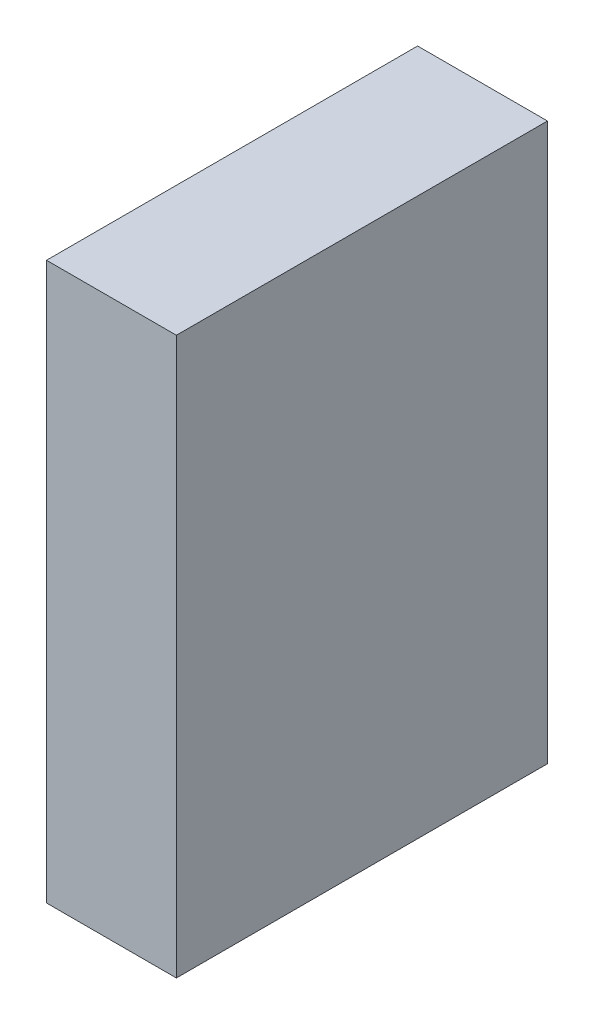
ISO-10303-21;
HEADER;
FILE_DESCRIPTION(('STEP AP214'),'2;1');
FILE_NAME('part.step','',(''),(''),'','','');
FILE_SCHEMA(('AUTOMOTIVE_DESIGN { 1 0 10303 214 1 1 1 1 }'));
ENDSEC;
DATA;
#1=APPLICATION_CONTEXT('core data for automotive mechanical design processes');
#2=APPLICATION_PROTOCOL_DEFINITION('international standard','automotive_design',2000,#1);
#3=PRODUCT_CONTEXT('',#1,'mechanical');
#4=PRODUCT('Part','Part','',(#3));
#5=PRODUCT_RELATED_PRODUCT_CATEGORY('part','',(#4));
#6=PRODUCT_DEFINITION_FORMATION('','',#4);
#7=PRODUCT_DEFINITION_CONTEXT('part definition',#1,'design');
#8=PRODUCT_DEFINITION('design','',#6,#7);
#9=PRODUCT_DEFINITION_SHAPE('','',#8);
#10=(LENGTH_UNIT() NAMED_UNIT(*) SI_UNIT(.MILLI.,.METRE.));
#11=(NAMED_UNIT(*) PLANE_ANGLE_UNIT() SI_UNIT($,.RADIAN.));
#12=(NAMED_UNIT(*) SI_UNIT($,.STERADIAN.) SOLID_ANGLE_UNIT());
#13=UNCERTAINTY_MEASURE_WITH_UNIT(LENGTH_MEASURE(1.E-05),#10,'distance_accuracy_value','');
#14=(GEOMETRIC_REPRESENTATION_CONTEXT(3) GLOBAL_UNCERTAINTY_ASSIGNED_CONTEXT((#13)) GLOBAL_UNIT_ASSIGNED_CONTEXT((#10,
#11,#12)) REPRESENTATION_CONTEXT('',''));
#15=CARTESIAN_POINT('',(0.,0.,0.));
#16=DIRECTION('',(0.,0.,1.));
#17=DIRECTION('',(1.,0.,0.));
#18=AXIS2_PLACEMENT_3D('',#15,#16,#17);
#19=CARTESIAN_POINT('',(0.0889,-0.381,0.));
#20=DIRECTION('',(-1.,0.,0.));
#21=DIRECTION('',(0.,0.,1.));
#22=AXIS2_PLACEMENT_3D('',#19,#20,#21);
#23=PLANE('',#22);
#24=DIRECTION('',(0.,0.,-1.));
#25=VECTOR('',#24,1.);
#26=CARTESIAN_POINT('',(0.0889,0.381,0.));
#27=LINE('',#26,#25);
#28=CARTESIAN_POINT('',(0.0889,0.381,0.));
#29=VERTEX_POINT('',#28);
#30=CARTESIAN_POINT('',(0.0889,0.381,0.508));
#31=VERTEX_POINT('',#30);
#32=EDGE_CURVE('E20',#29,#31,#27,.F.);
#33=ORIENTED_EDGE('',*,*,#32,.T.);
#34=DIRECTION('',(0.,1.,0.));
#35=VECTOR('',#34,1.);
#36=CARTESIAN_POINT('',(0.0889,0.381,0.508));
#37=LINE('',#36,#35);
#38=CARTESIAN_POINT('',(0.0889,-0.381,0.508));
#39=VERTEX_POINT('',#38);
#40=EDGE_CURVE('E55',#31,#39,#37,.F.);
#41=ORIENTED_EDGE('',*,*,#40,.T.);
#42=DIRECTION('',(0.,0.,1.));
#43=VECTOR('',#42,1.);
#44=CARTESIAN_POINT('',(0.0889,-0.381,0.));
#45=LINE('',#44,#43);
#46=CARTESIAN_POINT('',(0.0889,-0.381,0.));
#47=VERTEX_POINT('',#46);
#48=EDGE_CURVE('E74',#39,#47,#45,.F.);
#49=ORIENTED_EDGE('',*,*,#48,.T.);
#50=DIRECTION('',(0.,1.,0.));
#51=VECTOR('',#50,1.);
#52=CARTESIAN_POINT('',(0.0889,0.381,0.));
#53=LINE('',#52,#51);
#54=EDGE_CURVE('E66',#29,#47,#53,.F.);
#55=ORIENTED_EDGE('',*,*,#54,.F.);
#56=EDGE_LOOP('',(#33,#41,#49,#55));
#57=FACE_BOUND('',#56,.T.);
#58=ADVANCED_FACE('F17',(#57),#23,.F.);
#59=CARTESIAN_POINT('',(0.0889,0.381,0.));
#60=DIRECTION('',(0.,-1.,0.));
#61=DIRECTION('',(0.,0.,-1.));
#62=AXIS2_PLACEMENT_3D('',#59,#60,#61);
#63=PLANE('',#62);
#64=DIRECTION('',(0.,0.,-1.));
#65=VECTOR('',#64,1.);
#66=CARTESIAN_POINT('',(-0.08890000000001,0.381,0.));
#67=LINE('',#66,#65);
#68=CARTESIAN_POINT('',(-0.08890000000001,0.381,0.));
#69=VERTEX_POINT('',#68);
#70=CARTESIAN_POINT('',(-0.08890000000001,0.381,0.508));
#71=VERTEX_POINT('',#70);
#72=EDGE_CURVE('E72',#69,#71,#67,.F.);
#73=ORIENTED_EDGE('',*,*,#72,.T.);
#74=DIRECTION('',(-1.,0.,0.));
#75=VECTOR('',#74,1.);
#76=CARTESIAN_POINT('',(0.0889,0.381,0.508));
#77=LINE('',#76,#75);
#78=EDGE_CURVE('E62',#71,#31,#77,.F.);
#79=ORIENTED_EDGE('',*,*,#78,.T.);
#80=ORIENTED_EDGE('',*,*,#32,.F.);
#81=DIRECTION('',(-1.,0.,0.));
#82=VECTOR('',#81,1.);
#83=CARTESIAN_POINT('',(0.0889,0.381,0.));
#84=LINE('',#83,#82);
#85=EDGE_CURVE('E80',#69,#29,#84,.F.);
#86=ORIENTED_EDGE('',*,*,#85,.F.);
#87=EDGE_LOOP('',(#73,#79,#80,#86));
#88=FACE_BOUND('',#87,.T.);
#89=ADVANCED_FACE('F71',(#88),#63,.F.);
#90=CARTESIAN_POINT('',(0.0889,0.381,0.508));
#91=DIRECTION('',(0.,0.,-1.));
#92=DIRECTION('',(-1.,0.,0.));
#93=AXIS2_PLACEMENT_3D('',#90,#91,#92);
#94=PLANE('',#93);
#95=DIRECTION('',(0.,1.,0.));
#96=VECTOR('',#95,1.);
#97=CARTESIAN_POINT('',(-0.08890000000001,0.381,0.508));
#98=LINE('',#97,#96);
#99=CARTESIAN_POINT('',(-0.08890000000001,-0.381,0.508));
#100=VERTEX_POINT('',#99);
#101=EDGE_CURVE('E83',#71,#100,#98,.F.);
#102=ORIENTED_EDGE('',*,*,#101,.T.);
#103=DIRECTION('',(1.,0.,0.));
#104=VECTOR('',#103,1.);
#105=CARTESIAN_POINT('',(-0.08890000000001,-0.381,0.508));
#106=LINE('',#105,#104);
#107=EDGE_CURVE('E64',#100,#39,#106,.T.);
#108=ORIENTED_EDGE('',*,*,#107,.T.);
#109=ORIENTED_EDGE('',*,*,#40,.F.);
#110=ORIENTED_EDGE('',*,*,#78,.F.);
#111=EDGE_LOOP('',(#102,#108,#109,#110));
#112=FACE_BOUND('',#111,.T.);
#113=ADVANCED_FACE('F60',(#112),#94,.F.);
#114=CARTESIAN_POINT('',(-0.08890000000001,-0.381,0.));
#115=DIRECTION('',(0.,1.,0.));
#116=DIRECTION('',(0.,0.,1.));
#117=AXIS2_PLACEMENT_3D('',#114,#115,#116);
#118=PLANE('',#117);
#119=ORIENTED_EDGE('',*,*,#48,.F.);
#120=ORIENTED_EDGE('',*,*,#107,.F.);
#121=DIRECTION('',(0.,0.,-1.));
#122=VECTOR('',#121,1.);
#123=CARTESIAN_POINT('',(-0.08890000000001,-0.381,0.));
#124=LINE('',#123,#122);
#125=CARTESIAN_POINT('',(-0.08890000000001,-0.381,0.));
#126=VERTEX_POINT('',#125);
#127=EDGE_CURVE('E26',#100,#126,#124,.T.);
#128=ORIENTED_EDGE('',*,*,#127,.T.);
#129=DIRECTION('',(-1.,0.,0.));
#130=VECTOR('',#129,1.);
#131=CARTESIAN_POINT('',(0.0889,-0.381,0.));
#132=LINE('',#131,#130);
#133=EDGE_CURVE('E34',#47,#126,#132,.T.);
#134=ORIENTED_EDGE('',*,*,#133,.F.);
#135=EDGE_LOOP('',(#119,#120,#128,#134));
#136=FACE_BOUND('',#135,.T.);
#137=ADVANCED_FACE('F88',(#136),#118,.F.);
#138=CARTESIAN_POINT('',(0.0889,0.381,0.));
#139=DIRECTION('',(0.,0.,-1.));
#140=DIRECTION('',(-1.,0.,0.));
#141=AXIS2_PLACEMENT_3D('',#138,#139,#140);
#142=PLANE('',#141);
#143=DIRECTION('',(0.,1.,0.));
#144=VECTOR('',#143,1.);
#145=CARTESIAN_POINT('',(-0.08890000000001,0.381,0.));
#146=LINE('',#145,#144);
#147=EDGE_CURVE('E11',#126,#69,#146,.T.);
#148=ORIENTED_EDGE('',*,*,#147,.T.);
#149=ORIENTED_EDGE('',*,*,#85,.T.);
#150=ORIENTED_EDGE('',*,*,#54,.T.);
#151=ORIENTED_EDGE('',*,*,#133,.T.);
#152=EDGE_LOOP('',(#148,#149,#150,#151));
#153=FACE_BOUND('',#152,.T.);
#154=ADVANCED_FACE('F91',(#153),#142,.T.);
#155=CARTESIAN_POINT('',(-0.08890000000001,0.381,0.));
#156=DIRECTION('',(1.,0.,0.));
#157=DIRECTION('',(0.,0.,-1.));
#158=AXIS2_PLACEMENT_3D('',#155,#156,#157);
#159=PLANE('',#158);
#160=ORIENTED_EDGE('',*,*,#127,.F.);
#161=ORIENTED_EDGE('',*,*,#101,.F.);
#162=ORIENTED_EDGE('',*,*,#72,.F.);
#163=ORIENTED_EDGE('',*,*,#147,.F.);
#164=EDGE_LOOP('',(#160,#161,#162,#163));
#165=FACE_BOUND('',#164,.T.);
#166=ADVANCED_FACE('F90',(#165),#159,.F.);
#167=CLOSED_SHELL('',(#58,#89,#113,#137,#154,#166));
#168=MANIFOLD_SOLID_BREP('B1',#167);
#169=ADVANCED_BREP_SHAPE_REPRESENTATION('',(#18,#168),#14);
#170=SHAPE_DEFINITION_REPRESENTATION(#9,#169);
ENDSEC;
END-ISO-10303-21;
